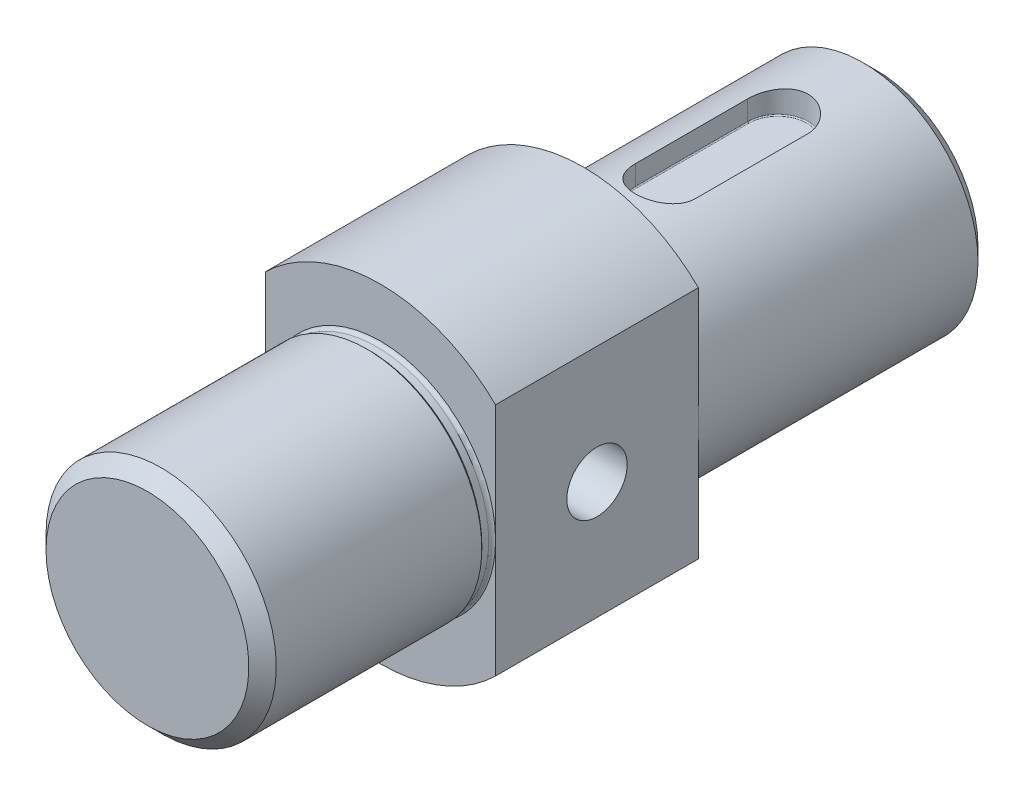
ISO-10303-21;
HEADER;
FILE_DESCRIPTION(('STEP AP214'),'2;1');
FILE_NAME('part.step','',(''),(''),'','','');
FILE_SCHEMA(('AUTOMOTIVE_DESIGN { 1 0 10303 214 1 1 1 1 }'));
ENDSEC;
DATA;
#1=APPLICATION_CONTEXT('core data for automotive mechanical design processes');
#2=APPLICATION_PROTOCOL_DEFINITION('international standard','automotive_design',2000,#1);
#3=PRODUCT_CONTEXT('',#1,'mechanical');
#4=PRODUCT('Part','Part','',(#3));
#5=PRODUCT_RELATED_PRODUCT_CATEGORY('part','',(#4));
#6=PRODUCT_DEFINITION_FORMATION('','',#4);
#7=PRODUCT_DEFINITION_CONTEXT('part definition',#1,'design');
#8=PRODUCT_DEFINITION('design','',#6,#7);
#9=PRODUCT_DEFINITION_SHAPE('','',#8);
#10=(LENGTH_UNIT() NAMED_UNIT(*) SI_UNIT(.MILLI.,.METRE.));
#11=(NAMED_UNIT(*) PLANE_ANGLE_UNIT() SI_UNIT($,.RADIAN.));
#12=(NAMED_UNIT(*) SI_UNIT($,.STERADIAN.) SOLID_ANGLE_UNIT());
#13=UNCERTAINTY_MEASURE_WITH_UNIT(LENGTH_MEASURE(1.E-05),#10,'distance_accuracy_value','');
#14=(GEOMETRIC_REPRESENTATION_CONTEXT(3) GLOBAL_UNCERTAINTY_ASSIGNED_CONTEXT((#13)) GLOBAL_UNIT_ASSIGNED_CONTEXT((#10,
#11,#12)) REPRESENTATION_CONTEXT('',''));
#15=CARTESIAN_POINT('',(0.,0.,0.));
#16=DIRECTION('',(0.,0.,1.));
#17=DIRECTION('',(1.,0.,0.));
#18=AXIS2_PLACEMENT_3D('',#15,#16,#17);
#19=CARTESIAN_POINT('',(0.,0.,-37.));
#20=DIRECTION('',(0.,0.,1.));
#21=DIRECTION('',(1.,0.,0.));
#22=AXIS2_PLACEMENT_3D('',#19,#20,#21);
#23=PLANE('',#22);
#24=CARTESIAN_POINT('',(0.,0.,-37.));
#25=DIRECTION('',(0.,0.,-1.));
#26=DIRECTION('',(-1.,0.,0.));
#27=AXIS2_PLACEMENT_3D('',#24,#25,#26);
#28=CIRCLE('',#27,60.);
#29=CARTESIAN_POINT('',(-42.,42.8485705712571,-37.));
#30=VERTEX_POINT('',#29);
#31=CARTESIAN_POINT('',(42.,42.8485705712571,-37.));
#32=VERTEX_POINT('',#31);
#33=EDGE_CURVE('E192',#30,#32,#28,.T.);
#34=ORIENTED_EDGE('',*,*,#33,.T.);
#35=DIRECTION('',(0.,1.,0.));
#36=VECTOR('',#35,1.);
#37=CARTESIAN_POINT('',(42.,-60.,-37.));
#38=LINE('',#37,#36);
#39=CARTESIAN_POINT('',(42.,0.,-37.));
#40=VERTEX_POINT('',#39);
#41=EDGE_CURVE('E142',#40,#32,#38,.T.);
#42=ORIENTED_EDGE('',*,*,#41,.F.);
#43=CARTESIAN_POINT('',(0.,0.,-37.));
#44=DIRECTION('',(0.,0.,-1.));
#45=DIRECTION('',(-1.,0.,0.));
#46=AXIS2_PLACEMENT_3D('',#43,#44,#45);
#47=CIRCLE('',#46,42.);
#48=CARTESIAN_POINT('',(-42.,0.,-37.));
#49=VERTEX_POINT('',#48);
#50=EDGE_CURVE('E193',#49,#40,#47,.T.);
#51=ORIENTED_EDGE('',*,*,#50,.F.);
#52=DIRECTION('',(0.,1.,0.));
#53=VECTOR('',#52,1.);
#54=CARTESIAN_POINT('',(-42.,-60.,-37.));
#55=LINE('',#54,#53);
#56=EDGE_CURVE('E139',#49,#30,#55,.T.);
#57=ORIENTED_EDGE('',*,*,#56,.T.);
#58=EDGE_LOOP('',(#34,#42,#51,#57));
#59=FACE_BOUND('',#58,.T.);
#60=ADVANCED_FACE('F37',(#59),#23,.F.);
#61=CARTESIAN_POINT('',(0.,0.,0.));
#62=DIRECTION('',(0.,0.,-1.));
#63=DIRECTION('',(-1.,0.,0.));
#64=AXIS2_PLACEMENT_3D('',#61,#62,#63);
#65=CYLINDRICAL_SURFACE('',#64,60.);
#66=CARTESIAN_POINT('',(42.,-42.8485705712571,-37.));
#67=VERTEX_POINT('',#66);
#68=CARTESIAN_POINT('',(-42.,-42.8485705712571,-37.));
#69=VERTEX_POINT('',#68);
#70=EDGE_CURVE('E189',#67,#69,#28,.T.);
#71=ORIENTED_EDGE('',*,*,#70,.F.);
#72=DIRECTION('',(0.,0.,-1.));
#73=VECTOR('',#72,1.);
#74=CARTESIAN_POINT('',(42.,-42.8485705712571,0.));
#75=LINE('',#74,#73);
#76=CARTESIAN_POINT('',(42.,-42.8485705712571,37.));
#77=VERTEX_POINT('',#76);
#78=EDGE_CURVE('E158',#67,#77,#75,.F.);
#79=ORIENTED_EDGE('',*,*,#78,.T.);
#80=CARTESIAN_POINT('',(0.,0.,37.));
#81=DIRECTION('',(0.,0.,-1.));
#82=DIRECTION('',(-1.,0.,0.));
#83=AXIS2_PLACEMENT_3D('',#80,#81,#82);
#84=CIRCLE('',#83,60.);
#85=CARTESIAN_POINT('',(-42.,-42.8485705712571,37.));
#86=VERTEX_POINT('',#85);
#87=EDGE_CURVE('E178',#77,#86,#84,.T.);
#88=ORIENTED_EDGE('',*,*,#87,.T.);
#89=DIRECTION('',(0.,0.,-1.));
#90=VECTOR('',#89,1.);
#91=CARTESIAN_POINT('',(-42.,-42.8485705712571,0.));
#92=LINE('',#91,#90);
#93=EDGE_CURVE('E52',#86,#69,#92,.T.);
#94=ORIENTED_EDGE('',*,*,#93,.T.);
#95=EDGE_LOOP('',(#71,#79,#88,#94));
#96=FACE_BOUND('',#95,.T.);
#97=ADVANCED_FACE('F251',(#96),#65,.T.);
#98=CARTESIAN_POINT('',(0.,0.,37.));
#99=DIRECTION('',(0.,0.,-1.));
#100=DIRECTION('',(-1.,0.,0.));
#101=AXIS2_PLACEMENT_3D('',#98,#99,#100);
#102=PLANE('',#101);
#103=ORIENTED_EDGE('',*,*,#87,.F.);
#104=DIRECTION('',(0.,1.,0.));
#105=VECTOR('',#104,1.);
#106=CARTESIAN_POINT('',(42.,-60.,37.));
#107=LINE('',#106,#105);
#108=CARTESIAN_POINT('',(42.,0.,37.));
#109=VERTEX_POINT('',#108);
#110=EDGE_CURVE('E145',#77,#109,#107,.T.);
#111=ORIENTED_EDGE('',*,*,#110,.T.);
#112=CARTESIAN_POINT('',(0.,0.,37.));
#113=DIRECTION('',(0.,0.,-1.));
#114=DIRECTION('',(-1.,0.,0.));
#115=AXIS2_PLACEMENT_3D('',#112,#113,#114);
#116=CIRCLE('',#115,42.);
#117=CARTESIAN_POINT('',(-42.,0.,37.));
#118=VERTEX_POINT('',#117);
#119=EDGE_CURVE('E162',#109,#118,#116,.T.);
#120=ORIENTED_EDGE('',*,*,#119,.T.);
#121=DIRECTION('',(0.,1.,0.));
#122=VECTOR('',#121,1.);
#123=CARTESIAN_POINT('',(-42.,-60.,37.));
#124=LINE('',#123,#122);
#125=EDGE_CURVE('E148',#86,#118,#124,.T.);
#126=ORIENTED_EDGE('',*,*,#125,.F.);
#127=EDGE_LOOP('',(#103,#111,#120,#126));
#128=FACE_BOUND('',#127,.T.);
#129=ADVANCED_FACE('F247',(#128),#102,.F.);
#130=CARTESIAN_POINT('',(0.,0.,-144.));
#131=DIRECTION('',(0.,0.,1.));
#132=DIRECTION('',(1.,0.,0.));
#133=AXIS2_PLACEMENT_3D('',#130,#131,#132);
#134=PLANE('',#133);
#135=CARTESIAN_POINT('',(0.,0.,-144.));
#136=DIRECTION('',(0.,0.,1.));
#137=DIRECTION('',(1.,0.,0.));
#138=AXIS2_PLACEMENT_3D('',#135,#136,#137);
#139=CIRCLE('',#138,37.);
#140=CARTESIAN_POINT('',(37.,0.,-144.));
#141=VERTEX_POINT('',#140);
#142=EDGE_CURVE('E349',#141,#141,#139,.F.);
#143=ORIENTED_EDGE('',*,*,#142,.T.);
#144=EDGE_LOOP('',(#143));
#145=FACE_BOUND('',#144,.T.);
#146=ADVANCED_FACE('F257',(#145),#134,.F.);
#147=CARTESIAN_POINT('',(0.,0.,0.));
#148=DIRECTION('',(0.,0.,-1.));
#149=DIRECTION('',(-1.,0.,0.));
#150=AXIS2_PLACEMENT_3D('',#147,#148,#149);
#151=CYLINDRICAL_SURFACE('',#150,42.);
#152=CARTESIAN_POINT('',(0.,0.,-139.));
#153=DIRECTION('',(0.,0.,1.));
#154=DIRECTION('',(1.,0.,0.));
#155=AXIS2_PLACEMENT_3D('',#152,#153,#154);
#156=CIRCLE('',#155,42.);
#157=CARTESIAN_POINT('',(42.,0.,-139.));
#158=VERTEX_POINT('',#157);
#159=EDGE_CURVE('E356',#158,#158,#156,.T.);
#160=ORIENTED_EDGE('',*,*,#159,.T.);
#161=EDGE_LOOP('',(#160));
#162=FACE_BOUND('',#161,.T.);
#163=DIRECTION('',(0.,0.,-1.));
#164=VECTOR('',#163,1.);
#165=CARTESIAN_POINT('',(-11.,40.5339363990225,0.));
#166=LINE('',#165,#164);
#167=CARTESIAN_POINT('',(-11.,40.5339363990225,-67.));
#168=VERTEX_POINT('',#167);
#169=CARTESIAN_POINT('',(-11.,40.5339363990225,-108.));
#170=VERTEX_POINT('',#169);
#171=EDGE_CURVE('E531',#168,#170,#166,.T.);
#172=ORIENTED_EDGE('',*,*,#171,.T.);
#173=CARTESIAN_POINT('',(-11.,40.5339363990225,-108.));
#174=CARTESIAN_POINT('',(-11.0000390897247,40.5338994088747,-108.303690409013));
#175=CARTESIAN_POINT('',(-10.9874252250334,40.537348135981,-108.607367795042));
#176=CARTESIAN_POINT('',(-10.937179538349,40.5509476024511,-109.212441551124));
#177=CARTESIAN_POINT('',(-10.8995522345588,40.56109713144,-109.513838323184));
#178=CARTESIAN_POINT('',(-10.799672341648,40.5878009108692,-110.111579297314));
#179=CARTESIAN_POINT('',(-10.7374715957625,40.6043416759485,-110.407932775151));
#180=CARTESIAN_POINT('',(-10.5889804147278,40.6433194885494,-110.994145032873));
#181=CARTESIAN_POINT('',(-10.5026895834743,40.6657566330226,-111.284003705882));
#182=CARTESIAN_POINT('',(-10.3067525456201,40.7158574962987,-111.855122170807));
#183=CARTESIAN_POINT('',(-10.1971151488689,40.7435192431489,-112.13638516066));
#184=CARTESIAN_POINT('',(-9.95526715377719,40.8032862585637,-112.688663708453));
#185=CARTESIAN_POINT('',(-9.8230480614179,40.835393198307,-112.959675363367));
#186=CARTESIAN_POINT('',(-9.53705170154256,40.9031322176304,-113.489560836913));
#187=CARTESIAN_POINT('',(-9.38327727517205,40.9387638324515,-113.748436249196));
#188=CARTESIAN_POINT('',(-9.05515087213793,41.0125898321212,-114.25257901947));
#189=CARTESIAN_POINT('',(-8.88078947307927,41.0507853869748,-114.497840070254));
#190=CARTESIAN_POINT('',(-8.50871280534467,41.1295360200861,-114.978259244107));
#191=CARTESIAN_POINT('',(-8.31057376257641,41.1701242739932,-115.213083823729));
#192=CARTESIAN_POINT('',(-7.89549133428712,41.2517384451663,-115.665204185698));
#193=CARTESIAN_POINT('',(-7.67855605435306,41.2927641671537,-115.882507446561));
#194=CARTESIAN_POINT('',(-7.22708616577734,41.3741689443628,-116.29840198518));
#195=CARTESIAN_POINT('',(-6.9925415914231,41.4145476174723,-116.496982521503));
#196=CARTESIAN_POINT('',(-6.50756537107181,41.4935165983802,-116.873887117473));
#197=CARTESIAN_POINT('',(-6.25713973120382,41.5321075728332,-117.052218764769));
#198=CARTESIAN_POINT('',(-5.73790731099042,41.60704603436,-117.390093167496));
#199=CARTESIAN_POINT('',(-5.46887429161281,41.6433489888211,-117.549298409502));
#200=CARTESIAN_POINT('',(-4.91783338640515,41.7120125880533,-117.844419738687));
#201=CARTESIAN_POINT('',(-4.63582532523382,41.7443731795267,-117.980335511022));
#202=CARTESIAN_POINT('',(-4.06085719411236,41.8042217416938,-118.227774572896));
#203=CARTESIAN_POINT('',(-3.7678990330576,41.8317105569156,-118.339302090954));
#204=CARTESIAN_POINT('',(-3.17310216743908,41.8810274363901,-118.537060195974));
#205=CARTESIAN_POINT('',(-2.87126369115119,41.9028556460121,-118.623291432574));
#206=CARTESIAN_POINT('',(-2.26770541391075,41.9398008136011,-118.768086377673));
#207=CARTESIAN_POINT('',(-1.96613070718356,41.9550555576855,-118.827219956107));
#208=CARTESIAN_POINT('',(-1.35883795740878,41.9791125943836,-118.920069148046));
#209=CARTESIAN_POINT('',(-1.05311996955808,41.9879149728701,-118.953785099826));
#210=CARTESIAN_POINT('',(-0.439851483804073,41.9988163377765,-118.99549817414));
#211=CARTESIAN_POINT('',(-0.132301207660605,42.000916119531,-119.003498348126));
#212=CARTESIAN_POINT('',(0.48235850820381,41.9983544718644,-118.993716472992));
#213=CARTESIAN_POINT('',(0.789467953907576,41.9936931350885,-118.975934777152));
#214=CARTESIAN_POINT('',(1.39348607982039,41.9779375894443,-118.915496594201));
#215=CARTESIAN_POINT('',(1.69046091500427,41.9670029827041,-118.873457116245));
#216=CARTESIAN_POINT('',(2.27970900925317,41.9391216493663,-118.765344855504));
#217=CARTESIAN_POINT('',(2.5719823577294,41.9221750372445,-118.699272530332));
#218=CARTESIAN_POINT('',(3.14982289586885,41.8827230575331,-118.543630864491));
#219=CARTESIAN_POINT('',(3.43538991879253,41.8602175518925,-118.454060940274));
#220=CARTESIAN_POINT('',(3.99789873544003,41.8102444988418,-118.252127018473));
#221=CARTESIAN_POINT('',(4.27484039727996,41.7827768756034,-118.139762672555));
#222=CARTESIAN_POINT('',(4.8208771015684,41.7233182915598,-117.891910528688));
#223=CARTESIAN_POINT('',(5.0898725604686,41.6912868237531,-117.756213124095));
#224=CARTESIAN_POINT('',(5.61559188485287,41.6237360174441,-117.463387054452));
#225=CARTESIAN_POINT('',(5.87231146877767,41.5882154750316,-117.306250984633));
#226=CARTESIAN_POINT('',(6.37175973754677,41.5146287627569,-116.97167888434));
#227=CARTESIAN_POINT('',(6.61448892179817,41.4765626838662,-116.794243579152));
#228=CARTESIAN_POINT('',(7.08446929592547,41.3988772471254,-116.420242871198));
#229=CARTESIAN_POINT('',(7.31172014716735,41.3592578553219,-116.223677050124));
#230=CARTESIAN_POINT('',(7.75585129285283,41.2783143202618,-115.806555958367));
#231=CARTESIAN_POINT('',(7.97222238091444,41.2369745140379,-115.585461205685));
#232=CARTESIAN_POINT('',(8.38556896633452,41.1549101727454,-115.125849485322));
#233=CARTESIAN_POINT('',(8.58255035137591,41.114185454105,-114.887337844835));
#234=CARTESIAN_POINT('',(8.95594523085845,41.0344674430569,-114.394272476613));
#235=CARTESIAN_POINT('',(9.13234924452815,40.9954749538354,-114.139711436871));
#236=CARTESIAN_POINT('',(9.46323243071654,40.9203619897027,-113.61632285023));
#237=CARTESIAN_POINT('',(9.61771228932441,40.8842414249337,-113.347495750132));
#238=CARTESIAN_POINT('',(9.90451892831085,40.8157126101962,-112.795604966288));
#239=CARTESIAN_POINT('',(10.0366982337429,40.7833294891655,-112.512461462656));
#240=CARTESIAN_POINT('',(10.276640690383,40.7235307238184,-111.935512362723));
#241=CARTESIAN_POINT('',(10.3844049593292,40.6961148521092,-111.641707255233));
#242=CARTESIAN_POINT('',(10.5745041019676,40.6471339823006,-111.04590301321));
#243=CARTESIAN_POINT('',(10.6568698271671,40.6255618896897,-110.743914308456));
#244=CARTESIAN_POINT('',(10.7955958428993,40.5889178334616,-110.13376102994));
#245=CARTESIAN_POINT('',(10.851968271673,40.5738428360733,-109.825599409075));
#246=CARTESIAN_POINT('',(10.9300268063771,40.55287742928,-109.264423891235));
#247=CARTESIAN_POINT('',(10.9562730467066,40.5457849107945,-109.012078950179));
#248=CARTESIAN_POINT('',(10.9912536770788,40.5363097313241,-108.50649623332));
#249=CARTESIAN_POINT('',(11.0000159657189,40.5339195670247,-108.25326052687));
#250=CARTESIAN_POINT('',(11.,40.5339363990225,-108.));
#251=B_SPLINE_CURVE_WITH_KNOTS('',3,(#173,#174,#175,#176,#177,#178,#179,#180,#181,#182,#183,
#184,#185,#186,#187,#188,#189,#190,#191,#192,#193,#194,#195,#196,#197,#198,#199,#200,#201,#202,
#203,#204,#205,#206,#207,#208,#209,#210,#211,#212,#213,#214,#215,#216,#217,#218,#219,#220,#221,
#222,#223,#224,#225,#226,#227,#228,#229,#230,#231,#232,#233,#234,#235,#236,#237,#238,#239,#240,
#241,#242,#243,#244,#245,#246,#247,#248,#249,#250),.UNSPECIFIED.,.F.,.F.,(4,2,2,2,2,2,2,2,2,2,2,
2,2,2,2,2,2,2,2,2,2,2,2,2,2,2,2,2,2,2,2,2,2,2,2,2,2,2,4),(0.,0.910769893012067,1.82137531741954,
2.73006978584064,3.63877919647053,4.54714631044468,5.45585585880811,6.36444574525175,
7.27345310556999,8.20213414454568,9.13041667861792,10.0592285786173,10.9876912782341,
11.9306764118082,12.8736742923788,13.8165085429517,14.7593185783273,15.6812714155769,
16.6032119826,17.5250431474958,18.4468616809943,19.3462065442891,20.2455342838943,
21.1448843598865,22.0442481804184,22.9521591596179,23.8603845227035,24.7685774452966,
25.6767902309005,26.6120052800681,27.5469354694728,28.4822947291758,29.417624711516,
30.358916294741,31.300164776243,32.2402653818625,33.1799265375198,33.9407131052392,
34.7002847356136),.UNSPECIFIED.);
#252=CARTESIAN_POINT('',(11.,40.5339363990225,-108.));
#253=VERTEX_POINT('',#252);
#254=EDGE_CURVE('E196',#170,#253,#251,.T.);
#255=ORIENTED_EDGE('',*,*,#254,.T.);
#256=DIRECTION('',(0.,0.,-1.));
#257=VECTOR('',#256,1.);
#258=CARTESIAN_POINT('',(11.,40.5339363990225,0.));
#259=LINE('',#258,#257);
#260=CARTESIAN_POINT('',(11.,40.5339363990225,-67.));
#261=VERTEX_POINT('',#260);
#262=EDGE_CURVE('E535',#253,#261,#259,.F.);
#263=ORIENTED_EDGE('',*,*,#262,.T.);
#264=CARTESIAN_POINT('',(11.,40.5339363990225,-67.));
#265=CARTESIAN_POINT('',(11.0000390897247,40.5338994088747,-66.6963095909875));
#266=CARTESIAN_POINT('',(10.9874252250334,40.537348135981,-66.3926322049578));
#267=CARTESIAN_POINT('',(10.937179538349,40.5509476024511,-65.7875584488758));
#268=CARTESIAN_POINT('',(10.8995522345588,40.56109713144,-65.486161676816));
#269=CARTESIAN_POINT('',(10.799672341648,40.5878009108692,-64.888420702686));
#270=CARTESIAN_POINT('',(10.7374715957625,40.6043416759485,-64.5920672248493));
#271=CARTESIAN_POINT('',(10.5889804147278,40.6433194885494,-64.005854967127));
#272=CARTESIAN_POINT('',(10.5026895834743,40.6657566330226,-63.7159962941179));
#273=CARTESIAN_POINT('',(10.3067525456201,40.7158574962987,-63.1448778291925));
#274=CARTESIAN_POINT('',(10.1971151488689,40.7435192431489,-62.8636148393404));
#275=CARTESIAN_POINT('',(9.95526715377719,40.8032862585637,-62.3113362915473));
#276=CARTESIAN_POINT('',(9.8230480614179,40.835393198307,-62.0403246366333));
#277=CARTESIAN_POINT('',(9.53705170154257,40.9031322176304,-61.5104391630875));
#278=CARTESIAN_POINT('',(9.38327727517206,40.9387638324515,-61.2515637508042));
#279=CARTESIAN_POINT('',(9.05515087213794,41.0125898321212,-60.7474209805303));
#280=CARTESIAN_POINT('',(8.88078947307928,41.0507853869748,-60.5021599297464));
#281=CARTESIAN_POINT('',(8.50871280534467,41.1295360200861,-60.0217407558926));
#282=CARTESIAN_POINT('',(8.31057376257641,41.1701242739932,-59.786916176271));
#283=CARTESIAN_POINT('',(7.89549133428712,41.2517384451664,-59.3347958143024));
#284=CARTESIAN_POINT('',(7.67855605435306,41.2927641671537,-59.1174925534392));
#285=CARTESIAN_POINT('',(7.22708616577734,41.3741689443628,-58.7015980148196));
#286=CARTESIAN_POINT('',(6.99254159142311,41.4145476174723,-58.5030174784972));
#287=CARTESIAN_POINT('',(6.50756537107182,41.4935165983802,-58.1261128825272));
#288=CARTESIAN_POINT('',(6.25713973120383,41.5321075728332,-57.947781235231));
#289=CARTESIAN_POINT('',(5.73790731099043,41.60704603436,-57.609906832504));
#290=CARTESIAN_POINT('',(5.46887429161282,41.6433489888211,-57.4507015904983));
#291=CARTESIAN_POINT('',(4.91783338640516,41.7120125880533,-57.155580261313));
#292=CARTESIAN_POINT('',(4.63582532523383,41.7443731795267,-57.0196644889785));
#293=CARTESIAN_POINT('',(4.06085719411236,41.8042217416938,-56.7722254271036));
#294=CARTESIAN_POINT('',(3.76789903305761,41.8317105569156,-56.660697909046));
#295=CARTESIAN_POINT('',(3.17310216743909,41.8810274363901,-56.4629398040263));
#296=CARTESIAN_POINT('',(2.8712636911512,41.9028556460121,-56.3767085674263));
#297=CARTESIAN_POINT('',(2.26770541391075,41.9398008136011,-56.2319136223267));
#298=CARTESIAN_POINT('',(1.96613070718356,41.9550555576855,-56.1727800438926));
#299=CARTESIAN_POINT('',(1.35883795740879,41.9791125943836,-56.0799308519544));
#300=CARTESIAN_POINT('',(1.05311996955809,41.9879149728701,-56.0462149001743));
#301=CARTESIAN_POINT('',(0.439851483804076,41.9988163377765,-56.0045018258598));
#302=CARTESIAN_POINT('',(0.132301207660608,42.000916119531,-55.996501651874));
#303=CARTESIAN_POINT('',(-0.482358508203808,41.9983544718644,-56.0062835270077));
#304=CARTESIAN_POINT('',(-0.789467953907574,41.9936931350885,-56.0240652228476));
#305=CARTESIAN_POINT('',(-1.39348607982039,41.9779375894443,-56.0845034057989));
#306=CARTESIAN_POINT('',(-1.69046091500427,41.9670029827041,-56.1265428837546));
#307=CARTESIAN_POINT('',(-2.27970900925316,41.9391216493663,-56.2346551444961));
#308=CARTESIAN_POINT('',(-2.57198235772939,41.9221750372445,-56.3007274696683));
#309=CARTESIAN_POINT('',(-3.14982289586885,41.8827230575331,-56.4563691355087));
#310=CARTESIAN_POINT('',(-3.43538991879253,41.8602175518925,-56.545939059726));
#311=CARTESIAN_POINT('',(-3.99789873544003,41.8102444988418,-56.7478729815266));
#312=CARTESIAN_POINT('',(-4.27484039727996,41.7827768756034,-56.8602373274452));
#313=CARTESIAN_POINT('',(-4.82087710156839,41.7233182915598,-57.1080894713119));
#314=CARTESIAN_POINT('',(-5.08987256046859,41.6912868237531,-57.2437868759047));
#315=CARTESIAN_POINT('',(-5.61559188485286,41.6237360174441,-57.5366129455481));
#316=CARTESIAN_POINT('',(-5.87231146877766,41.5882154750316,-57.6937490153671));
#317=CARTESIAN_POINT('',(-6.37175973754676,41.5146287627569,-58.0283211156598));
#318=CARTESIAN_POINT('',(-6.61448892179817,41.4765626838662,-58.2057564208479));
#319=CARTESIAN_POINT('',(-7.08446929592547,41.3988772471254,-58.5797571288023));
#320=CARTESIAN_POINT('',(-7.31172014716735,41.3592578553219,-58.7763229498764));
#321=CARTESIAN_POINT('',(-7.75585129285282,41.2783143202618,-59.1934440416334));
#322=CARTESIAN_POINT('',(-7.97222238091443,41.2369745140379,-59.4145387943153));
#323=CARTESIAN_POINT('',(-8.38556896633451,41.1549101727454,-59.8741505146777));
#324=CARTESIAN_POINT('',(-8.5825503513759,41.114185454105,-60.1126621551648));
#325=CARTESIAN_POINT('',(-8.95594523085845,41.0344674430569,-60.6057275233866));
#326=CARTESIAN_POINT('',(-9.13234924452815,40.9954749538354,-60.8602885631292));
#327=CARTESIAN_POINT('',(-9.46323243071654,40.9203619897027,-61.3836771497699));
#328=CARTESIAN_POINT('',(-9.61771228932441,40.8842414249337,-61.6525042498676));
#329=CARTESIAN_POINT('',(-9.90451892831085,40.8157126101962,-62.2043950337116));
#330=CARTESIAN_POINT('',(-10.0366982337429,40.7833294891655,-62.4875385373441));
#331=CARTESIAN_POINT('',(-10.276640690383,40.7235307238184,-63.0644876372773));
#332=CARTESIAN_POINT('',(-10.3844049593292,40.6961148521092,-63.3582927447673));
#333=CARTESIAN_POINT('',(-10.5745041019676,40.6471339823006,-63.9540969867899));
#334=CARTESIAN_POINT('',(-10.6568698271671,40.6255618896897,-64.2560856915442));
#335=CARTESIAN_POINT('',(-10.7955958428993,40.5889178334616,-64.8662389700601));
#336=CARTESIAN_POINT('',(-10.851968271673,40.5738428360733,-65.1744005909248));
#337=CARTESIAN_POINT('',(-10.9300268063771,40.55287742928,-65.7355761087653));
#338=CARTESIAN_POINT('',(-10.9562730467066,40.5457849107945,-65.9879210498209));
#339=CARTESIAN_POINT('',(-10.9912536770788,40.5363097313241,-66.4935037666797));
#340=CARTESIAN_POINT('',(-11.0000159657189,40.5339195670247,-66.7467394731296));
#341=CARTESIAN_POINT('',(-11.,40.5339363990225,-67.));
#342=B_SPLINE_CURVE_WITH_KNOTS('',3,(#264,#265,#266,#267,#268,#269,#270,#271,#272,#273,#274,
#275,#276,#277,#278,#279,#280,#281,#282,#283,#284,#285,#286,#287,#288,#289,#290,#291,#292,#293,
#294,#295,#296,#297,#298,#299,#300,#301,#302,#303,#304,#305,#306,#307,#308,#309,#310,#311,#312,
#313,#314,#315,#316,#317,#318,#319,#320,#321,#322,#323,#324,#325,#326,#327,#328,#329,#330,#331,
#332,#333,#334,#335,#336,#337,#338,#339,#340,#341),.UNSPECIFIED.,.F.,.F.,(4,2,2,2,2,2,2,2,2,2,2,
2,2,2,2,2,2,2,2,2,2,2,2,2,2,2,2,2,2,2,2,2,2,2,2,2,2,2,4),(0.,0.910769893012067,1.82137531741954,
2.73006978584066,3.63877919647053,4.54714631044468,5.45585585880811,6.36444574525173,
7.27345310556999,8.20213414454568,9.13041667861792,10.0592285786173,10.9876912782341,
11.9306764118082,12.8736742923788,13.8165085429517,14.7593185783273,15.6812714155769,
16.6032119826,17.5250431474958,18.4468616809943,19.3462065442891,20.2455342838944,
21.1448843598865,22.0442481804184,22.9521591596179,23.8603845227035,24.7685774452966,
25.6767902309005,26.6120052800681,27.5469354694728,28.4822947291758,29.417624711516,
30.358916294741,31.300164776243,32.2402653818625,33.1799265375198,33.9407131052392,
34.7002847356136),.UNSPECIFIED.);
#343=EDGE_CURVE('E205',#261,#168,#342,.T.);
#344=ORIENTED_EDGE('',*,*,#343,.T.);
#345=EDGE_LOOP('',(#172,#255,#263,#344));
#346=FACE_BOUND('',#345,.T.);
#347=ORIENTED_EDGE('',*,*,#50,.T.);
#348=EDGE_CURVE('E197',#40,#49,#47,.T.);
#349=ORIENTED_EDGE('',*,*,#348,.T.);
#350=EDGE_LOOP('',(#347,#349));
#351=FACE_BOUND('',#350,.T.);
#352=ADVANCED_FACE('F211',(#162,#346,#351),#151,.T.);
#353=ORIENTED_EDGE('',*,*,#348,.F.);
#354=EDGE_CURVE('E144',#67,#40,#38,.T.);
#355=ORIENTED_EDGE('',*,*,#354,.F.);
#356=ORIENTED_EDGE('',*,*,#70,.T.);
#357=EDGE_CURVE('E151',#69,#49,#55,.T.);
#358=ORIENTED_EDGE('',*,*,#357,.T.);
#359=EDGE_LOOP('',(#353,#355,#356,#358));
#360=FACE_BOUND('',#359,.T.);
#361=ADVANCED_FACE('F249',(#360),#23,.F.);
#362=CARTESIAN_POINT('',(-42.,42.8485705712571,37.));
#363=VERTEX_POINT('',#362);
#364=CARTESIAN_POINT('',(42.,42.8485705712571,37.));
#365=VERTEX_POINT('',#364);
#366=EDGE_CURVE('E188',#363,#365,#84,.T.);
#367=ORIENTED_EDGE('',*,*,#366,.T.);
#368=DIRECTION('',(0.,0.,-1.));
#369=VECTOR('',#368,1.);
#370=CARTESIAN_POINT('',(42.,42.8485705712571,0.));
#371=LINE('',#370,#369);
#372=EDGE_CURVE('E60',#365,#32,#371,.T.);
#373=ORIENTED_EDGE('',*,*,#372,.T.);
#374=ORIENTED_EDGE('',*,*,#33,.F.);
#375=DIRECTION('',(0.,0.,-1.));
#376=VECTOR('',#375,1.);
#377=CARTESIAN_POINT('',(-42.,42.8485705712571,0.));
#378=LINE('',#377,#376);
#379=EDGE_CURVE('E154',#30,#363,#378,.F.);
#380=ORIENTED_EDGE('',*,*,#379,.T.);
#381=EDGE_LOOP('',(#367,#373,#374,#380));
#382=FACE_BOUND('',#381,.T.);
#383=ADVANCED_FACE('F245',(#382),#65,.T.);
#384=EDGE_CURVE('E163',#118,#109,#116,.T.);
#385=ORIENTED_EDGE('',*,*,#384,.T.);
#386=EDGE_CURVE('E146',#109,#365,#107,.T.);
#387=ORIENTED_EDGE('',*,*,#386,.T.);
#388=ORIENTED_EDGE('',*,*,#366,.F.);
#389=EDGE_CURVE('E149',#118,#363,#124,.T.);
#390=ORIENTED_EDGE('',*,*,#389,.F.);
#391=EDGE_LOOP('',(#385,#387,#388,#390));
#392=FACE_BOUND('',#391,.T.);
#393=ADVANCED_FACE('F231',(#392),#102,.F.);
#394=CARTESIAN_POINT('',(0.,33.,-67.));
#395=DIRECTION('',(0.,1.,0.));
#396=DIRECTION('',(0.,0.,1.));
#397=AXIS2_PLACEMENT_3D('',#394,#395,#396);
#398=CYLINDRICAL_SURFACE('',#397,11.);
#399=DIRECTION('',(0.,1.,0.));
#400=VECTOR('',#399,1.);
#401=CARTESIAN_POINT('',(11.,33.,-67.));
#402=LINE('',#401,#400);
#403=CARTESIAN_POINT('',(11.,33.4,-67.));
#404=VERTEX_POINT('',#403);
#405=EDGE_CURVE('E183',#404,#261,#402,.T.);
#406=ORIENTED_EDGE('',*,*,#405,.F.);
#407=CARTESIAN_POINT('',(0.,33.4,-67.));
#408=DIRECTION('',(0.,1.,0.));
#409=DIRECTION('',(0.,0.,1.));
#410=AXIS2_PLACEMENT_3D('',#407,#408,#409);
#411=CIRCLE('',#410,11.);
#412=CARTESIAN_POINT('',(-11.,33.4,-67.));
#413=VERTEX_POINT('',#412);
#414=EDGE_CURVE('E345',#404,#413,#411,.F.);
#415=ORIENTED_EDGE('',*,*,#414,.T.);
#416=DIRECTION('',(0.,1.,0.));
#417=VECTOR('',#416,1.);
#418=CARTESIAN_POINT('',(-11.,33.,-67.));
#419=LINE('',#418,#417);
#420=EDGE_CURVE('E176',#413,#168,#419,.T.);
#421=ORIENTED_EDGE('',*,*,#420,.T.);
#422=ORIENTED_EDGE('',*,*,#343,.F.);
#423=EDGE_LOOP('',(#406,#415,#421,#422));
#424=FACE_BOUND('',#423,.T.);
#425=ADVANCED_FACE('F227',(#424),#398,.F.);
#426=CARTESIAN_POINT('',(-11.,33.,-67.));
#427=DIRECTION('',(-1.,0.,0.));
#428=DIRECTION('',(0.,0.,1.));
#429=AXIS2_PLACEMENT_3D('',#426,#427,#428);
#430=PLANE('',#429);
#431=ORIENTED_EDGE('',*,*,#420,.F.);
#432=DIRECTION('',(0.,0.,1.));
#433=VECTOR('',#432,1.);
#434=CARTESIAN_POINT('',(-11.,33.4,-67.));
#435=LINE('',#434,#433);
#436=CARTESIAN_POINT('',(-11.,33.4,-108.));
#437=VERTEX_POINT('',#436);
#438=EDGE_CURVE('E347',#413,#437,#435,.F.);
#439=ORIENTED_EDGE('',*,*,#438,.T.);
#440=DIRECTION('',(0.,1.,0.));
#441=VECTOR('',#440,1.);
#442=CARTESIAN_POINT('',(-11.,33.,-108.));
#443=LINE('',#442,#441);
#444=EDGE_CURVE('E179',#437,#170,#443,.T.);
#445=ORIENTED_EDGE('',*,*,#444,.T.);
#446=ORIENTED_EDGE('',*,*,#171,.F.);
#447=EDGE_LOOP('',(#431,#439,#445,#446));
#448=FACE_BOUND('',#447,.T.);
#449=ADVANCED_FACE('F221',(#448),#430,.F.);
#450=CARTESIAN_POINT('',(0.,33.,-108.));
#451=DIRECTION('',(0.,1.,0.));
#452=DIRECTION('',(0.,0.,1.));
#453=AXIS2_PLACEMENT_3D('',#450,#451,#452);
#454=CYLINDRICAL_SURFACE('',#453,11.);
#455=ORIENTED_EDGE('',*,*,#444,.F.);
#456=CARTESIAN_POINT('',(0.,33.4,-108.));
#457=DIRECTION('',(0.,1.,0.));
#458=DIRECTION('',(0.,0.,1.));
#459=AXIS2_PLACEMENT_3D('',#456,#457,#458);
#460=CIRCLE('',#459,11.);
#461=CARTESIAN_POINT('',(11.,33.4,-108.));
#462=VERTEX_POINT('',#461);
#463=EDGE_CURVE('E339',#437,#462,#460,.F.);
#464=ORIENTED_EDGE('',*,*,#463,.T.);
#465=DIRECTION('',(0.,1.,0.));
#466=VECTOR('',#465,1.);
#467=CARTESIAN_POINT('',(11.,33.,-108.));
#468=LINE('',#467,#466);
#469=EDGE_CURVE('E181',#462,#253,#468,.T.);
#470=ORIENTED_EDGE('',*,*,#469,.T.);
#471=ORIENTED_EDGE('',*,*,#254,.F.);
#472=EDGE_LOOP('',(#455,#464,#470,#471));
#473=FACE_BOUND('',#472,.T.);
#474=ADVANCED_FACE('F215',(#473),#454,.F.);
#475=CARTESIAN_POINT('',(11.,33.,-67.));
#476=DIRECTION('',(1.,0.,0.));
#477=DIRECTION('',(0.,0.,-1.));
#478=AXIS2_PLACEMENT_3D('',#475,#476,#477);
#479=PLANE('',#478);
#480=ORIENTED_EDGE('',*,*,#469,.F.);
#481=DIRECTION('',(0.,0.,-1.));
#482=VECTOR('',#481,1.);
#483=CARTESIAN_POINT('',(11.,33.4,-67.));
#484=LINE('',#483,#482);
#485=EDGE_CURVE('E330',#462,#404,#484,.F.);
#486=ORIENTED_EDGE('',*,*,#485,.T.);
#487=ORIENTED_EDGE('',*,*,#405,.T.);
#488=ORIENTED_EDGE('',*,*,#262,.F.);
#489=EDGE_LOOP('',(#480,#486,#487,#488));
#490=FACE_BOUND('',#489,.T.);
#491=ADVANCED_FACE('F220',(#490),#479,.F.);
#492=CARTESIAN_POINT('',(0.,33.,-67.));
#493=DIRECTION('',(0.,1.,0.));
#494=DIRECTION('',(0.,0.,1.));
#495=AXIS2_PLACEMENT_3D('',#492,#493,#494);
#496=PLANE('',#495);
#497=DIRECTION('',(0.,0.,-1.));
#498=VECTOR('',#497,1.);
#499=CARTESIAN_POINT('',(10.6,33.,-67.));
#500=LINE('',#499,#498);
#501=CARTESIAN_POINT('',(10.6,33.,-67.));
#502=VERTEX_POINT('',#501);
#503=CARTESIAN_POINT('',(10.6,33.,-108.));
#504=VERTEX_POINT('',#503);
#505=EDGE_CURVE('E318',#502,#504,#500,.T.);
#506=ORIENTED_EDGE('',*,*,#505,.T.);
#507=CARTESIAN_POINT('',(0.,33.,-108.));
#508=DIRECTION('',(0.,1.,0.));
#509=DIRECTION('',(0.,0.,1.));
#510=AXIS2_PLACEMENT_3D('',#507,#508,#509);
#511=CIRCLE('',#510,10.6);
#512=CARTESIAN_POINT('',(-10.6,33.,-108.));
#513=VERTEX_POINT('',#512);
#514=EDGE_CURVE('E321',#504,#513,#511,.T.);
#515=ORIENTED_EDGE('',*,*,#514,.T.);
#516=DIRECTION('',(0.,0.,1.));
#517=VECTOR('',#516,1.);
#518=CARTESIAN_POINT('',(-10.6,33.,-67.));
#519=LINE('',#518,#517);
#520=CARTESIAN_POINT('',(-10.6,33.,-67.));
#521=VERTEX_POINT('',#520);
#522=EDGE_CURVE('E529',#513,#521,#519,.T.);
#523=ORIENTED_EDGE('',*,*,#522,.T.);
#524=CARTESIAN_POINT('',(0.,33.,-67.));
#525=DIRECTION('',(0.,1.,0.));
#526=DIRECTION('',(0.,0.,1.));
#527=AXIS2_PLACEMENT_3D('',#524,#525,#526);
#528=CIRCLE('',#527,10.6);
#529=EDGE_CURVE('E323',#521,#502,#528,.T.);
#530=ORIENTED_EDGE('',*,*,#529,.T.);
#531=EDGE_LOOP('',(#506,#515,#523,#530));
#532=FACE_BOUND('',#531,.T.);
#533=ADVANCED_FACE('F225',(#532),#496,.T.);
#534=CARTESIAN_POINT('',(0.,33.4,-67.));
#535=DIRECTION('',(0.,1.,0.));
#536=DIRECTION('',(0.,0.,1.));
#537=AXIS2_PLACEMENT_3D('',#534,#535,#536);
#538=TOROIDAL_SURFACE('',#537,10.6,0.4);
#539=CARTESIAN_POINT('',(-10.6,33.4,-67.));
#540=DIRECTION('',(0.,0.,1.));
#541=DIRECTION('',(1.,0.,0.));
#542=AXIS2_PLACEMENT_3D('',#539,#540,#541);
#543=CIRCLE('',#542,0.4);
#544=EDGE_CURVE('E334',#413,#521,#543,.T.);
#545=ORIENTED_EDGE('',*,*,#544,.F.);
#546=ORIENTED_EDGE('',*,*,#414,.F.);
#547=CARTESIAN_POINT('',(10.6,33.4,-67.));
#548=DIRECTION('',(0.,0.,1.));
#549=DIRECTION('',(1.,0.,0.));
#550=AXIS2_PLACEMENT_3D('',#547,#548,#549);
#551=CIRCLE('',#550,0.4);
#552=EDGE_CURVE('E185',#502,#404,#551,.T.);
#553=ORIENTED_EDGE('',*,*,#552,.F.);
#554=ORIENTED_EDGE('',*,*,#529,.F.);
#555=EDGE_LOOP('',(#545,#546,#553,#554));
#556=FACE_BOUND('',#555,.T.);
#557=ADVANCED_FACE('F308',(#556),#538,.F.);
#558=CARTESIAN_POINT('',(10.6,33.4,-67.));
#559=DIRECTION('',(0.,0.,-1.));
#560=DIRECTION('',(-1.,0.,0.));
#561=AXIS2_PLACEMENT_3D('',#558,#559,#560);
#562=CYLINDRICAL_SURFACE('',#561,0.4);
#563=ORIENTED_EDGE('',*,*,#552,.T.);
#564=ORIENTED_EDGE('',*,*,#485,.F.);
#565=CARTESIAN_POINT('',(10.6,33.4,-108.));
#566=DIRECTION('',(0.,0.,1.));
#567=DIRECTION('',(1.,0.,0.));
#568=AXIS2_PLACEMENT_3D('',#565,#566,#567);
#569=CIRCLE('',#568,0.4);
#570=EDGE_CURVE('E329',#504,#462,#569,.T.);
#571=ORIENTED_EDGE('',*,*,#570,.F.);
#572=ORIENTED_EDGE('',*,*,#505,.F.);
#573=EDGE_LOOP('',(#563,#564,#571,#572));
#574=FACE_BOUND('',#573,.T.);
#575=ADVANCED_FACE('F313',(#574),#562,.F.);
#576=CARTESIAN_POINT('',(-10.6,33.4,-67.));
#577=DIRECTION('',(0.,0.,1.));
#578=DIRECTION('',(1.,0.,0.));
#579=AXIS2_PLACEMENT_3D('',#576,#577,#578);
#580=CYLINDRICAL_SURFACE('',#579,0.4);
#581=ORIENTED_EDGE('',*,*,#544,.T.);
#582=ORIENTED_EDGE('',*,*,#522,.F.);
#583=CARTESIAN_POINT('',(-10.6,33.4,-108.));
#584=DIRECTION('',(0.,0.,1.));
#585=DIRECTION('',(1.,0.,0.));
#586=AXIS2_PLACEMENT_3D('',#583,#584,#585);
#587=CIRCLE('',#586,0.4);
#588=EDGE_CURVE('E175',#437,#513,#587,.T.);
#589=ORIENTED_EDGE('',*,*,#588,.F.);
#590=ORIENTED_EDGE('',*,*,#438,.F.);
#591=EDGE_LOOP('',(#581,#582,#589,#590));
#592=FACE_BOUND('',#591,.T.);
#593=ADVANCED_FACE('F511',(#592),#580,.F.);
#594=CARTESIAN_POINT('',(0.,33.4,-108.));
#595=DIRECTION('',(0.,1.,0.));
#596=DIRECTION('',(0.,0.,1.));
#597=AXIS2_PLACEMENT_3D('',#594,#595,#596);
#598=TOROIDAL_SURFACE('',#597,10.6,0.4);
#599=ORIENTED_EDGE('',*,*,#570,.T.);
#600=ORIENTED_EDGE('',*,*,#463,.F.);
#601=ORIENTED_EDGE('',*,*,#588,.T.);
#602=ORIENTED_EDGE('',*,*,#514,.F.);
#603=EDGE_LOOP('',(#599,#600,#601,#602));
#604=FACE_BOUND('',#603,.T.);
#605=ADVANCED_FACE('F336',(#604),#598,.F.);
#606=CARTESIAN_POINT('',(0.,0.,-144.));
#607=DIRECTION('',(0.,0.,1.));
#608=DIRECTION('',(1.,0.,0.));
#609=AXIS2_PLACEMENT_3D('',#606,#607,#608);
#610=CONICAL_SURFACE('',#609,37.,0.785398163397446);
#611=ORIENTED_EDGE('',*,*,#159,.F.);
#612=EDGE_LOOP('',(#611));
#613=FACE_BOUND('',#612,.T.);
#614=ORIENTED_EDGE('',*,*,#142,.F.);
#615=EDGE_LOOP('',(#614));
#616=FACE_BOUND('',#615,.T.);
#617=ADVANCED_FACE('F305',(#613,#616),#610,.T.);
#618=CARTESIAN_POINT('',(0.,0.,38.4832396974192));
#619=DIRECTION('',(0.,0.,-1.));
#620=DIRECTION('',(-1.,0.,0.));
#621=AXIS2_PLACEMENT_3D('',#618,#619,#620);
#622=TOROIDAL_SURFACE('',#621,42.6,1.60000000000002);
#623=ORIENTED_EDGE('',*,*,#384,.F.);
#624=ORIENTED_EDGE('',*,*,#119,.F.);
#625=EDGE_LOOP('',(#623,#624));
#626=FACE_BOUND('',#625,.T.);
#627=CARTESIAN_POINT('',(0.,0.,38.4832396974192));
#628=DIRECTION('',(0.,0.,-1.));
#629=DIRECTION('',(-1.,0.,0.));
#630=AXIS2_PLACEMENT_3D('',#627,#628,#629);
#631=CIRCLE('',#630,41.);
#632=CARTESIAN_POINT('',(-41.,0.,38.4832396974192));
#633=VERTEX_POINT('',#632);
#634=EDGE_CURVE('E172',#633,#633,#631,.T.);
#635=ORIENTED_EDGE('',*,*,#634,.T.);
#636=EDGE_LOOP('',(#635));
#637=FACE_BOUND('',#636,.T.);
#638=ADVANCED_FACE('F302',(#626,#637),#622,.F.);
#639=CARTESIAN_POINT('',(0.,0.,0.));
#640=DIRECTION('',(0.,0.,-1.));
#641=DIRECTION('',(-1.,0.,0.));
#642=AXIS2_PLACEMENT_3D('',#639,#640,#641);
#643=CYLINDRICAL_SURFACE('',#642,41.);
#644=ORIENTED_EDGE('',*,*,#634,.F.);
#645=EDGE_LOOP('',(#644));
#646=FACE_BOUND('',#645,.T.);
#647=CARTESIAN_POINT('',(0.,0.,41.));
#648=DIRECTION('',(0.,0.,-1.));
#649=DIRECTION('',(-1.,0.,0.));
#650=AXIS2_PLACEMENT_3D('',#647,#648,#649);
#651=CIRCLE('',#650,41.);
#652=CARTESIAN_POINT('',(-41.,0.,41.));
#653=VERTEX_POINT('',#652);
#654=EDGE_CURVE('E169',#653,#653,#651,.T.);
#655=ORIENTED_EDGE('',*,*,#654,.T.);
#656=EDGE_LOOP('',(#655));
#657=FACE_BOUND('',#656,.T.);
#658=ADVANCED_FACE('F298',(#646,#657),#643,.T.);
#659=CARTESIAN_POINT('',(0.,0.,42.));
#660=DIRECTION('',(0.,0.,1.));
#661=DIRECTION('',(1.,0.,0.));
#662=AXIS2_PLACEMENT_3D('',#659,#660,#661);
#663=CONICAL_SURFACE('',#662,42.,0.785398163397442);
#664=ORIENTED_EDGE('',*,*,#654,.F.);
#665=EDGE_LOOP('',(#664));
#666=FACE_BOUND('',#665,.T.);
#667=CARTESIAN_POINT('',(0.,0.,42.));
#668=DIRECTION('',(0.,0.,-1.));
#669=DIRECTION('',(-1.,0.,0.));
#670=AXIS2_PLACEMENT_3D('',#667,#668,#669);
#671=CIRCLE('',#670,42.);
#672=CARTESIAN_POINT('',(-42.,0.,42.));
#673=VERTEX_POINT('',#672);
#674=EDGE_CURVE('E166',#673,#673,#671,.T.);
#675=ORIENTED_EDGE('',*,*,#674,.T.);
#676=EDGE_LOOP('',(#675));
#677=FACE_BOUND('',#676,.T.);
#678=ADVANCED_FACE('F236',(#666,#677),#663,.T.);
#679=CARTESIAN_POINT('',(0.,0.,122.));
#680=DIRECTION('',(0.,0.,-1.));
#681=DIRECTION('',(-1.,0.,0.));
#682=AXIS2_PLACEMENT_3D('',#679,#680,#681);
#683=PLANE('',#682);
#684=CARTESIAN_POINT('',(0.,0.,122.));
#685=DIRECTION('',(0.,0.,-1.));
#686=DIRECTION('',(-1.,0.,0.));
#687=AXIS2_PLACEMENT_3D('',#684,#685,#686);
#688=CIRCLE('',#687,37.);
#689=CARTESIAN_POINT('',(-37.,0.,122.));
#690=VERTEX_POINT('',#689);
#691=EDGE_CURVE('E11',#690,#690,#688,.F.);
#692=ORIENTED_EDGE('',*,*,#691,.T.);
#693=EDGE_LOOP('',(#692));
#694=FACE_BOUND('',#693,.T.);
#695=ADVANCED_FACE('F233',(#694),#683,.F.);
#696=CARTESIAN_POINT('',(0.,0.,117.));
#697=DIRECTION('',(0.,0.,-1.));
#698=DIRECTION('',(-1.,0.,0.));
#699=AXIS2_PLACEMENT_3D('',#696,#697,#698);
#700=CONICAL_SURFACE('',#699,42.,0.785398163397449);
#701=ORIENTED_EDGE('',*,*,#691,.F.);
#702=EDGE_LOOP('',(#701));
#703=FACE_BOUND('',#702,.T.);
#704=CARTESIAN_POINT('',(0.,0.,117.));
#705=DIRECTION('',(0.,0.,-1.));
#706=DIRECTION('',(-1.,0.,0.));
#707=AXIS2_PLACEMENT_3D('',#704,#705,#706);
#708=CIRCLE('',#707,42.);
#709=CARTESIAN_POINT('',(-42.,0.,117.));
#710=VERTEX_POINT('',#709);
#711=EDGE_CURVE('E45',#710,#710,#708,.T.);
#712=ORIENTED_EDGE('',*,*,#711,.F.);
#713=EDGE_LOOP('',(#712));
#714=FACE_BOUND('',#713,.T.);
#715=ADVANCED_FACE('F39',(#703,#714),#700,.T.);
#716=CARTESIAN_POINT('',(0.,0.,0.));
#717=DIRECTION('',(0.,0.,-1.));
#718=DIRECTION('',(-1.,0.,0.));
#719=AXIS2_PLACEMENT_3D('',#716,#717,#718);
#720=CYLINDRICAL_SURFACE('',#719,42.);
#721=ORIENTED_EDGE('',*,*,#674,.F.);
#722=EDGE_LOOP('',(#721));
#723=FACE_BOUND('',#722,.T.);
#724=ORIENTED_EDGE('',*,*,#711,.T.);
#725=EDGE_LOOP('',(#724));
#726=FACE_BOUND('',#725,.T.);
#727=ADVANCED_FACE('F238',(#723,#726),#720,.T.);
#728=CARTESIAN_POINT('',(-42.,-60.,-37.));
#729=DIRECTION('',(1.,0.,0.));
#730=DIRECTION('',(0.,0.,-1.));
#731=AXIS2_PLACEMENT_3D('',#728,#729,#730);
#732=PLANE('',#731);
#733=ORIENTED_EDGE('',*,*,#125,.T.);
#734=ORIENTED_EDGE('',*,*,#389,.T.);
#735=ORIENTED_EDGE('',*,*,#379,.F.);
#736=ORIENTED_EDGE('',*,*,#56,.F.);
#737=ORIENTED_EDGE('',*,*,#357,.F.);
#738=ORIENTED_EDGE('',*,*,#93,.F.);
#739=EDGE_LOOP('',(#733,#734,#735,#736,#737,#738));
#740=FACE_BOUND('',#739,.T.);
#741=ADVANCED_FACE('F241',(#740),#732,.F.);
#742=CARTESIAN_POINT('',(42.,-60.,-37.));
#743=DIRECTION('',(-1.,0.,0.));
#744=DIRECTION('',(0.,0.,1.));
#745=AXIS2_PLACEMENT_3D('',#742,#743,#744);
#746=PLANE('',#745);
#747=CARTESIAN_POINT('',(42.,0.,0.));
#748=DIRECTION('',(1.,0.,0.));
#749=DIRECTION('',(0.,0.,-1.));
#750=AXIS2_PLACEMENT_3D('',#747,#748,#749);
#751=CIRCLE('',#750,11.);
#752=CARTESIAN_POINT('',(42.,0.,-11.));
#753=VERTEX_POINT('',#752);
#754=EDGE_CURVE('E136',#753,#753,#751,.T.);
#755=ORIENTED_EDGE('',*,*,#754,.F.);
#756=EDGE_LOOP('',(#755));
#757=FACE_BOUND('',#756,.T.);
#758=ORIENTED_EDGE('',*,*,#386,.F.);
#759=ORIENTED_EDGE('',*,*,#110,.F.);
#760=ORIENTED_EDGE('',*,*,#78,.F.);
#761=ORIENTED_EDGE('',*,*,#354,.T.);
#762=ORIENTED_EDGE('',*,*,#41,.T.);
#763=ORIENTED_EDGE('',*,*,#372,.F.);
#764=EDGE_LOOP('',(#758,#759,#760,#761,#762,#763));
#765=FACE_BOUND('',#764,.T.);
#766=ADVANCED_FACE('F284',(#757,#765),#746,.F.);
#767=CARTESIAN_POINT('',(-12.05,0.,0.));
#768=DIRECTION('',(1.,0.,0.));
#769=DIRECTION('',(0.,0.,-1.));
#770=AXIS2_PLACEMENT_3D('',#767,#768,#769);
#771=CYLINDRICAL_SURFACE('',#770,11.);
#772=CARTESIAN_POINT('',(-12.05,0.,0.));
#773=DIRECTION('',(-1.,0.,0.));
#774=DIRECTION('',(0.,0.,1.));
#775=AXIS2_PLACEMENT_3D('',#772,#773,#774);
#776=CIRCLE('',#775,11.);
#777=CARTESIAN_POINT('',(-12.05,0.,11.));
#778=VERTEX_POINT('',#777);
#779=EDGE_CURVE('E134',#778,#778,#776,.T.);
#780=ORIENTED_EDGE('',*,*,#779,.T.);
#781=EDGE_LOOP('',(#780));
#782=FACE_BOUND('',#781,.T.);
#783=ORIENTED_EDGE('',*,*,#754,.T.);
#784=EDGE_LOOP('',(#783));
#785=FACE_BOUND('',#784,.T.);
#786=ADVANCED_FACE('F130',(#782,#785),#771,.F.);
#787=CARTESIAN_POINT('',(-12.05,0.,0.));
#788=DIRECTION('',(1.,0.,0.));
#789=DIRECTION('',(0.,0.,-1.));
#790=AXIS2_PLACEMENT_3D('',#787,#788,#789);
#791=CONICAL_SURFACE('',#790,11.,0.87266462599716);
#792=CARTESIAN_POINT('',(-21.2800959429502,0.,0.));
#793=VERTEX_POINT('',#792);
#794=VERTEX_LOOP('',#793);
#795=FACE_BOUND('',#794,.T.);
#796=ORIENTED_EDGE('',*,*,#779,.F.);
#797=EDGE_LOOP('',(#796));
#798=FACE_BOUND('',#797,.T.);
#799=ADVANCED_FACE('F127',(#795,#798),#791,.F.);
#800=CLOSED_SHELL('',(#60,#97,#129,#146,#352,#361,#383,#393,#425,#449,#474,#491,#533,#557,#575,
#593,#605,#617,#638,#658,#678,#695,#715,#727,#741,#766,#786,#799));
#801=MANIFOLD_SOLID_BREP('B2',#800);
#802=ADVANCED_BREP_SHAPE_REPRESENTATION('',(#18,#801),#14);
#803=SHAPE_DEFINITION_REPRESENTATION(#9,#802);
ENDSEC;
END-ISO-10303-21;
